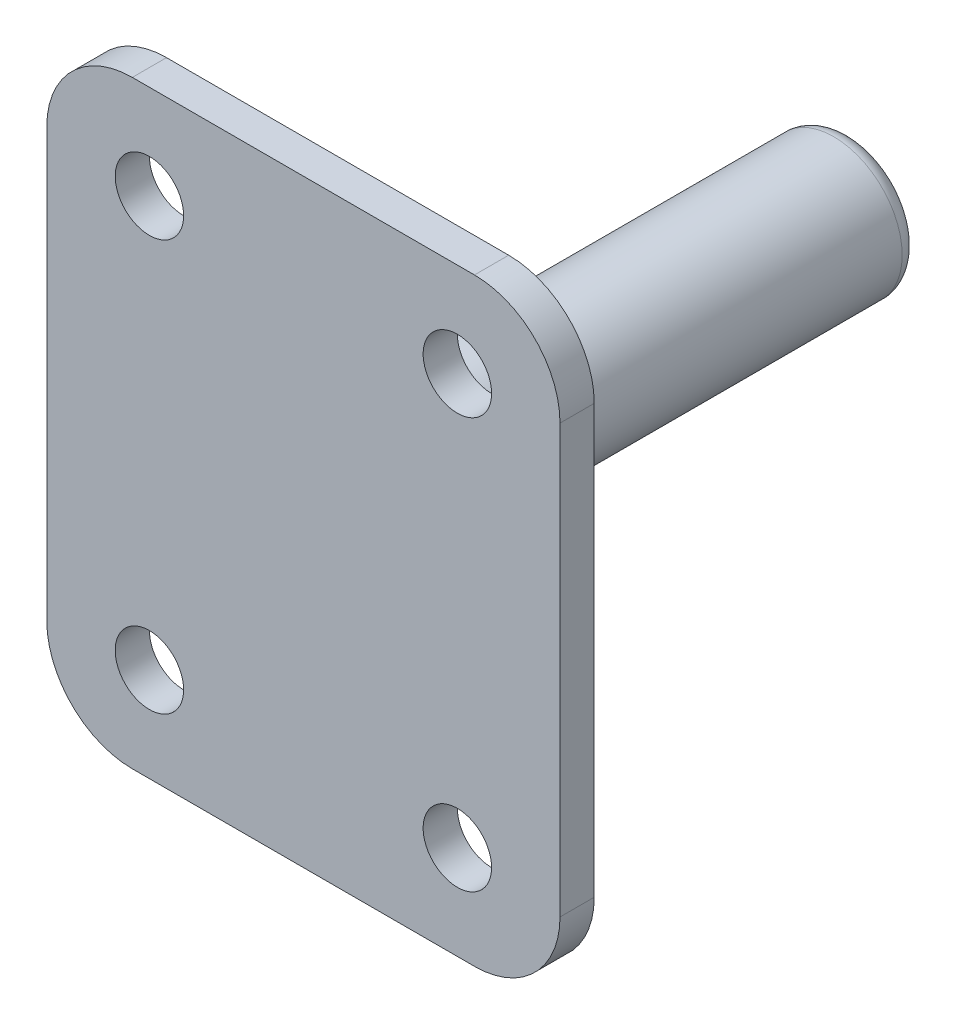
ISO-10303-21;
HEADER;
FILE_DESCRIPTION(('STEP AP214'),'2;1');
FILE_NAME('part.step','',(''),(''),'','','');
FILE_SCHEMA(('AUTOMOTIVE_DESIGN { 1 0 10303 214 1 1 1 1 }'));
ENDSEC;
DATA;
#1=APPLICATION_CONTEXT('core data for automotive mechanical design processes');
#2=APPLICATION_PROTOCOL_DEFINITION('international standard','automotive_design',2000,#1);
#3=PRODUCT_CONTEXT('',#1,'mechanical');
#4=PRODUCT('Part','Part','',(#3));
#5=PRODUCT_RELATED_PRODUCT_CATEGORY('part','',(#4));
#6=PRODUCT_DEFINITION_FORMATION('','',#4);
#7=PRODUCT_DEFINITION_CONTEXT('part definition',#1,'design');
#8=PRODUCT_DEFINITION('design','',#6,#7);
#9=PRODUCT_DEFINITION_SHAPE('','',#8);
#10=(LENGTH_UNIT() NAMED_UNIT(*) SI_UNIT(.MILLI.,.METRE.));
#11=(NAMED_UNIT(*) PLANE_ANGLE_UNIT() SI_UNIT($,.RADIAN.));
#12=(NAMED_UNIT(*) SI_UNIT($,.STERADIAN.) SOLID_ANGLE_UNIT());
#13=UNCERTAINTY_MEASURE_WITH_UNIT(LENGTH_MEASURE(1.E-05),#10,'distance_accuracy_value','');
#14=(GEOMETRIC_REPRESENTATION_CONTEXT(3) GLOBAL_UNCERTAINTY_ASSIGNED_CONTEXT((#13)) GLOBAL_UNIT_ASSIGNED_CONTEXT((#10,
#11,#12)) REPRESENTATION_CONTEXT('',''));
#15=CARTESIAN_POINT('',(0.,0.,0.));
#16=DIRECTION('',(0.,0.,1.));
#17=DIRECTION('',(1.,0.,0.));
#18=AXIS2_PLACEMENT_3D('',#15,#16,#17);
#19=CARTESIAN_POINT('',(0.,0.,2.));
#20=DIRECTION('',(1.,0.,0.));
#21=DIRECTION('',(0.,1.,0.));
#22=AXIS2_PLACEMENT_3D('',#19,#20,#21);
#23=PLANE('',#22);
#24=DIRECTION('',(0.,-1.,0.));
#25=VECTOR('',#24,1.);
#26=CARTESIAN_POINT('',(0.,0.,0.));
#27=LINE('',#26,#25);
#28=CARTESIAN_POINT('',(0.,-5.,0.));
#29=VERTEX_POINT('',#28);
#30=CARTESIAN_POINT('',(0.,-30.,0.));
#31=VERTEX_POINT('',#30);
#32=EDGE_CURVE('E127',#29,#31,#27,.T.);
#33=ORIENTED_EDGE('',*,*,#32,.T.);
#34=DIRECTION('',(0.,0.,-1.));
#35=VECTOR('',#34,1.);
#36=CARTESIAN_POINT('',(0.,-30.,2.));
#37=LINE('',#36,#35);
#38=CARTESIAN_POINT('',(0.,-30.,2.));
#39=VERTEX_POINT('',#38);
#40=EDGE_CURVE('E105',#31,#39,#37,.F.);
#41=ORIENTED_EDGE('',*,*,#40,.T.);
#42=DIRECTION('',(0.,-1.,0.));
#43=VECTOR('',#42,1.);
#44=CARTESIAN_POINT('',(0.,0.,2.));
#45=LINE('',#44,#43);
#46=CARTESIAN_POINT('',(0.,-5.,2.));
#47=VERTEX_POINT('',#46);
#48=EDGE_CURVE('E137',#47,#39,#45,.T.);
#49=ORIENTED_EDGE('',*,*,#48,.F.);
#50=DIRECTION('',(0.,0.,-1.));
#51=VECTOR('',#50,1.);
#52=CARTESIAN_POINT('',(0.,-5.,2.));
#53=LINE('',#52,#51);
#54=EDGE_CURVE('E110',#47,#29,#53,.T.);
#55=ORIENTED_EDGE('',*,*,#54,.T.);
#56=EDGE_LOOP('',(#33,#41,#49,#55));
#57=FACE_BOUND('',#56,.T.);
#58=ADVANCED_FACE('F33',(#57),#23,.F.);
#59=CARTESIAN_POINT('',(0.,-35.,2.));
#60=DIRECTION('',(0.,1.,0.));
#61=DIRECTION('',(0.,0.,1.));
#62=AXIS2_PLACEMENT_3D('',#59,#60,#61);
#63=PLANE('',#62);
#64=DIRECTION('',(1.,0.,0.));
#65=VECTOR('',#64,1.);
#66=CARTESIAN_POINT('',(0.,-35.,2.));
#67=LINE('',#66,#65);
#68=CARTESIAN_POINT('',(5.,-35.,2.));
#69=VERTEX_POINT('',#68);
#70=CARTESIAN_POINT('',(25.,-35.,2.));
#71=VERTEX_POINT('',#70);
#72=EDGE_CURVE('E120',#69,#71,#67,.T.);
#73=ORIENTED_EDGE('',*,*,#72,.F.);
#74=DIRECTION('',(0.,0.,-1.));
#75=VECTOR('',#74,1.);
#76=CARTESIAN_POINT('',(5.,-35.,2.));
#77=LINE('',#76,#75);
#78=CARTESIAN_POINT('',(5.,-35.,0.));
#79=VERTEX_POINT('',#78);
#80=EDGE_CURVE('E104',#69,#79,#77,.T.);
#81=ORIENTED_EDGE('',*,*,#80,.T.);
#82=DIRECTION('',(1.,0.,0.));
#83=VECTOR('',#82,1.);
#84=CARTESIAN_POINT('',(0.,-35.,0.));
#85=LINE('',#84,#83);
#86=CARTESIAN_POINT('',(25.,-35.,0.));
#87=VERTEX_POINT('',#86);
#88=EDGE_CURVE('E117',#79,#87,#85,.T.);
#89=ORIENTED_EDGE('',*,*,#88,.T.);
#90=DIRECTION('',(0.,0.,-1.));
#91=VECTOR('',#90,1.);
#92=CARTESIAN_POINT('',(25.,-35.,2.));
#93=LINE('',#92,#91);
#94=EDGE_CURVE('E122',#87,#71,#93,.F.);
#95=ORIENTED_EDGE('',*,*,#94,.T.);
#96=EDGE_LOOP('',(#73,#81,#89,#95));
#97=FACE_BOUND('',#96,.T.);
#98=ADVANCED_FACE('F116',(#97),#63,.F.);
#99=CARTESIAN_POINT('',(30.,0.,2.));
#100=DIRECTION('',(-1.,0.,0.));
#101=DIRECTION('',(0.,0.,1.));
#102=AXIS2_PLACEMENT_3D('',#99,#100,#101);
#103=PLANE('',#102);
#104=DIRECTION('',(0.,1.,0.));
#105=VECTOR('',#104,1.);
#106=CARTESIAN_POINT('',(30.,0.,2.));
#107=LINE('',#106,#105);
#108=CARTESIAN_POINT('',(30.,-30.,2.));
#109=VERTEX_POINT('',#108);
#110=CARTESIAN_POINT('',(30.,-5.00000000000001,2.));
#111=VERTEX_POINT('',#110);
#112=EDGE_CURVE('E225',#109,#111,#107,.T.);
#113=ORIENTED_EDGE('',*,*,#112,.F.);
#114=DIRECTION('',(0.,0.,-1.));
#115=VECTOR('',#114,1.);
#116=CARTESIAN_POINT('',(30.,-30.,2.));
#117=LINE('',#116,#115);
#118=CARTESIAN_POINT('',(30.,-30.,0.));
#119=VERTEX_POINT('',#118);
#120=EDGE_CURVE('E156',#109,#119,#117,.T.);
#121=ORIENTED_EDGE('',*,*,#120,.T.);
#122=DIRECTION('',(0.,1.,0.));
#123=VECTOR('',#122,1.);
#124=CARTESIAN_POINT('',(30.,0.,0.));
#125=LINE('',#124,#123);
#126=CARTESIAN_POINT('',(30.,-5.00000000000001,0.));
#127=VERTEX_POINT('',#126);
#128=EDGE_CURVE('E126',#119,#127,#125,.T.);
#129=ORIENTED_EDGE('',*,*,#128,.T.);
#130=DIRECTION('',(0.,0.,-1.));
#131=VECTOR('',#130,1.);
#132=CARTESIAN_POINT('',(30.,-5.00000000000001,2.));
#133=LINE('',#132,#131);
#134=EDGE_CURVE('E154',#127,#111,#133,.F.);
#135=ORIENTED_EDGE('',*,*,#134,.T.);
#136=EDGE_LOOP('',(#113,#121,#129,#135));
#137=FACE_BOUND('',#136,.T.);
#138=ADVANCED_FACE('F196',(#137),#103,.F.);
#139=CARTESIAN_POINT('',(0.,0.,2.));
#140=DIRECTION('',(0.,-1.,0.));
#141=DIRECTION('',(1.,0.,0.));
#142=AXIS2_PLACEMENT_3D('',#139,#140,#141);
#143=PLANE('',#142);
#144=DIRECTION('',(-1.,0.,0.));
#145=VECTOR('',#144,1.);
#146=CARTESIAN_POINT('',(0.,0.,2.));
#147=LINE('',#146,#145);
#148=CARTESIAN_POINT('',(25.,0.,2.));
#149=VERTEX_POINT('',#148);
#150=CARTESIAN_POINT('',(5.,0.,2.));
#151=VERTEX_POINT('',#150);
#152=EDGE_CURVE('E138',#149,#151,#147,.T.);
#153=ORIENTED_EDGE('',*,*,#152,.F.);
#154=DIRECTION('',(0.,0.,-1.));
#155=VECTOR('',#154,1.);
#156=CARTESIAN_POINT('',(25.,0.,2.));
#157=LINE('',#156,#155);
#158=CARTESIAN_POINT('',(25.,0.,0.));
#159=VERTEX_POINT('',#158);
#160=EDGE_CURVE('E160',#149,#159,#157,.T.);
#161=ORIENTED_EDGE('',*,*,#160,.T.);
#162=DIRECTION('',(-1.,0.,0.));
#163=VECTOR('',#162,1.);
#164=CARTESIAN_POINT('',(0.,0.,0.));
#165=LINE('',#164,#163);
#166=CARTESIAN_POINT('',(5.,0.,0.));
#167=VERTEX_POINT('',#166);
#168=EDGE_CURVE('E130',#159,#167,#165,.T.);
#169=ORIENTED_EDGE('',*,*,#168,.T.);
#170=DIRECTION('',(0.,0.,-1.));
#171=VECTOR('',#170,1.);
#172=CARTESIAN_POINT('',(5.,0.,2.));
#173=LINE('',#172,#171);
#174=EDGE_CURVE('E48',#167,#151,#173,.F.);
#175=ORIENTED_EDGE('',*,*,#174,.T.);
#176=EDGE_LOOP('',(#153,#161,#169,#175));
#177=FACE_BOUND('',#176,.T.);
#178=ADVANCED_FACE('F237',(#177),#143,.F.);
#179=CARTESIAN_POINT('',(0.,0.,2.));
#180=DIRECTION('',(0.,0.,1.));
#181=DIRECTION('',(1.,0.,0.));
#182=AXIS2_PLACEMENT_3D('',#179,#180,#181);
#183=PLANE('',#182);
#184=CARTESIAN_POINT('',(24.,-5.50000000000001,2.));
#185=DIRECTION('',(0.,0.,1.));
#186=DIRECTION('',(1.,0.,0.));
#187=AXIS2_PLACEMENT_3D('',#184,#185,#186);
#188=CIRCLE('',#187,2.);
#189=CARTESIAN_POINT('',(26.,-5.50000000000001,2.));
#190=VERTEX_POINT('',#189);
#191=EDGE_CURVE('E378',#190,#190,#188,.T.);
#192=ORIENTED_EDGE('',*,*,#191,.F.);
#193=EDGE_LOOP('',(#192));
#194=FACE_BOUND('',#193,.T.);
#195=CARTESIAN_POINT('',(6.,-29.5,2.));
#196=DIRECTION('',(0.,0.,1.));
#197=DIRECTION('',(1.,0.,0.));
#198=AXIS2_PLACEMENT_3D('',#195,#196,#197);
#199=CIRCLE('',#198,2.);
#200=CARTESIAN_POINT('',(8.,-29.5,2.));
#201=VERTEX_POINT('',#200);
#202=EDGE_CURVE('E375',#201,#201,#199,.T.);
#203=ORIENTED_EDGE('',*,*,#202,.F.);
#204=EDGE_LOOP('',(#203));
#205=FACE_BOUND('',#204,.T.);
#206=CARTESIAN_POINT('',(24.,-29.5,2.));
#207=DIRECTION('',(0.,0.,1.));
#208=DIRECTION('',(1.,0.,0.));
#209=AXIS2_PLACEMENT_3D('',#206,#207,#208);
#210=CIRCLE('',#209,2.00000000000001);
#211=CARTESIAN_POINT('',(26.,-29.5,2.));
#212=VERTEX_POINT('',#211);
#213=EDGE_CURVE('E373',#212,#212,#210,.T.);
#214=ORIENTED_EDGE('',*,*,#213,.F.);
#215=EDGE_LOOP('',(#214));
#216=FACE_BOUND('',#215,.T.);
#217=CARTESIAN_POINT('',(6.,-5.50000000000001,2.));
#218=DIRECTION('',(0.,0.,1.));
#219=DIRECTION('',(1.,0.,0.));
#220=AXIS2_PLACEMENT_3D('',#217,#218,#219);
#221=CIRCLE('',#220,2.);
#222=CARTESIAN_POINT('',(8.,-5.50000000000001,2.));
#223=VERTEX_POINT('',#222);
#224=EDGE_CURVE('E168',#223,#223,#221,.T.);
#225=ORIENTED_EDGE('',*,*,#224,.F.);
#226=EDGE_LOOP('',(#225));
#227=FACE_BOUND('',#226,.T.);
#228=ORIENTED_EDGE('',*,*,#48,.T.);
#229=CARTESIAN_POINT('',(5.,-30.,2.));
#230=DIRECTION('',(0.,0.,1.));
#231=DIRECTION('',(1.,0.,0.));
#232=AXIS2_PLACEMENT_3D('',#229,#230,#231);
#233=CIRCLE('',#232,5.);
#234=EDGE_CURVE('E152',#39,#69,#233,.T.);
#235=ORIENTED_EDGE('',*,*,#234,.T.);
#236=ORIENTED_EDGE('',*,*,#72,.T.);
#237=CARTESIAN_POINT('',(25.,-30.,2.));
#238=DIRECTION('',(0.,0.,1.));
#239=DIRECTION('',(1.,0.,0.));
#240=AXIS2_PLACEMENT_3D('',#237,#238,#239);
#241=CIRCLE('',#240,5.);
#242=EDGE_CURVE('E150',#71,#109,#241,.T.);
#243=ORIENTED_EDGE('',*,*,#242,.T.);
#244=ORIENTED_EDGE('',*,*,#112,.T.);
#245=CARTESIAN_POINT('',(25.,-5.00000000000001,2.));
#246=DIRECTION('',(0.,0.,1.));
#247=DIRECTION('',(1.,0.,0.));
#248=AXIS2_PLACEMENT_3D('',#245,#246,#247);
#249=CIRCLE('',#248,5.);
#250=EDGE_CURVE('E55',#111,#149,#249,.T.);
#251=ORIENTED_EDGE('',*,*,#250,.T.);
#252=ORIENTED_EDGE('',*,*,#152,.T.);
#253=CARTESIAN_POINT('',(5.,-5.,2.));
#254=DIRECTION('',(0.,0.,1.));
#255=DIRECTION('',(1.,0.,0.));
#256=AXIS2_PLACEMENT_3D('',#253,#254,#255);
#257=CIRCLE('',#256,5.);
#258=EDGE_CURVE('E147',#151,#47,#257,.T.);
#259=ORIENTED_EDGE('',*,*,#258,.T.);
#260=EDGE_LOOP('',(#228,#235,#236,#243,#244,#251,#252,#259));
#261=FACE_BOUND('',#260,.T.);
#262=ADVANCED_FACE('F223',(#194,#205,#216,#227,#261),#183,.T.);
#263=CARTESIAN_POINT('',(0.,0.,0.));
#264=DIRECTION('',(0.,0.,1.));
#265=DIRECTION('',(1.,0.,0.));
#266=AXIS2_PLACEMENT_3D('',#263,#264,#265);
#267=PLANE('',#266);
#268=CARTESIAN_POINT('',(15.,-17.5,0.));
#269=DIRECTION('',(0.,0.,1.));
#270=DIRECTION('',(1.,0.,0.));
#271=AXIS2_PLACEMENT_3D('',#268,#269,#270);
#272=CIRCLE('',#271,4.);
#273=CARTESIAN_POINT('',(19.,-17.5,0.));
#274=VERTEX_POINT('',#273);
#275=EDGE_CURVE('E163',#274,#274,#272,.F.);
#276=ORIENTED_EDGE('',*,*,#275,.F.);
#277=EDGE_LOOP('',(#276));
#278=FACE_BOUND('',#277,.T.);
#279=CARTESIAN_POINT('',(24.,-5.50000000000001,0.));
#280=DIRECTION('',(0.,0.,1.));
#281=DIRECTION('',(1.,0.,0.));
#282=AXIS2_PLACEMENT_3D('',#279,#280,#281);
#283=CIRCLE('',#282,2.);
#284=CARTESIAN_POINT('',(26.,-5.50000000000001,0.));
#285=VERTEX_POINT('',#284);
#286=EDGE_CURVE('E132',#285,#285,#283,.T.);
#287=ORIENTED_EDGE('',*,*,#286,.T.);
#288=EDGE_LOOP('',(#287));
#289=FACE_BOUND('',#288,.T.);
#290=CARTESIAN_POINT('',(6.,-29.5,0.));
#291=DIRECTION('',(0.,0.,1.));
#292=DIRECTION('',(1.,0.,0.));
#293=AXIS2_PLACEMENT_3D('',#290,#291,#292);
#294=CIRCLE('',#293,2.);
#295=CARTESIAN_POINT('',(8.,-29.5,0.));
#296=VERTEX_POINT('',#295);
#297=EDGE_CURVE('E171',#296,#296,#294,.T.);
#298=ORIENTED_EDGE('',*,*,#297,.T.);
#299=EDGE_LOOP('',(#298));
#300=FACE_BOUND('',#299,.T.);
#301=CARTESIAN_POINT('',(24.,-29.5,0.));
#302=DIRECTION('',(0.,0.,1.));
#303=DIRECTION('',(1.,0.,0.));
#304=AXIS2_PLACEMENT_3D('',#301,#302,#303);
#305=CIRCLE('',#304,2.00000000000001);
#306=CARTESIAN_POINT('',(26.,-29.5,0.));
#307=VERTEX_POINT('',#306);
#308=EDGE_CURVE('E167',#307,#307,#305,.T.);
#309=ORIENTED_EDGE('',*,*,#308,.T.);
#310=EDGE_LOOP('',(#309));
#311=FACE_BOUND('',#310,.T.);
#312=CARTESIAN_POINT('',(6.,-5.50000000000001,0.));
#313=DIRECTION('',(0.,0.,1.));
#314=DIRECTION('',(1.,0.,0.));
#315=AXIS2_PLACEMENT_3D('',#312,#313,#314);
#316=CIRCLE('',#315,2.);
#317=CARTESIAN_POINT('',(8.,-5.50000000000001,0.));
#318=VERTEX_POINT('',#317);
#319=EDGE_CURVE('E164',#318,#318,#316,.T.);
#320=ORIENTED_EDGE('',*,*,#319,.T.);
#321=EDGE_LOOP('',(#320));
#322=FACE_BOUND('',#321,.T.);
#323=ORIENTED_EDGE('',*,*,#88,.F.);
#324=CARTESIAN_POINT('',(5.,-30.,0.));
#325=DIRECTION('',(0.,0.,1.));
#326=DIRECTION('',(1.,0.,0.));
#327=AXIS2_PLACEMENT_3D('',#324,#325,#326);
#328=CIRCLE('',#327,5.);
#329=EDGE_CURVE('E100',#79,#31,#328,.F.);
#330=ORIENTED_EDGE('',*,*,#329,.T.);
#331=ORIENTED_EDGE('',*,*,#32,.F.);
#332=CARTESIAN_POINT('',(5.,-5.,0.));
#333=DIRECTION('',(0.,0.,1.));
#334=DIRECTION('',(1.,0.,0.));
#335=AXIS2_PLACEMENT_3D('',#332,#333,#334);
#336=CIRCLE('',#335,5.);
#337=EDGE_CURVE('E121',#29,#167,#336,.F.);
#338=ORIENTED_EDGE('',*,*,#337,.T.);
#339=ORIENTED_EDGE('',*,*,#168,.F.);
#340=CARTESIAN_POINT('',(25.,-5.00000000000001,0.));
#341=DIRECTION('',(0.,0.,1.));
#342=DIRECTION('',(1.,0.,0.));
#343=AXIS2_PLACEMENT_3D('',#340,#341,#342);
#344=CIRCLE('',#343,5.);
#345=EDGE_CURVE('E141',#159,#127,#344,.F.);
#346=ORIENTED_EDGE('',*,*,#345,.T.);
#347=ORIENTED_EDGE('',*,*,#128,.F.);
#348=CARTESIAN_POINT('',(25.,-30.,0.));
#349=DIRECTION('',(0.,0.,1.));
#350=DIRECTION('',(1.,0.,0.));
#351=AXIS2_PLACEMENT_3D('',#348,#349,#350);
#352=CIRCLE('',#351,5.);
#353=EDGE_CURVE('E111',#119,#87,#352,.F.);
#354=ORIENTED_EDGE('',*,*,#353,.T.);
#355=EDGE_LOOP('',(#323,#330,#331,#338,#339,#346,#347,#354));
#356=FACE_BOUND('',#355,.T.);
#357=ADVANCED_FACE('F124',(#278,#289,#300,#311,#322,#356),#267,.F.);
#358=CARTESIAN_POINT('',(5.,-30.,2.));
#359=DIRECTION('',(0.,0.,-1.));
#360=DIRECTION('',(-1.,0.,0.));
#361=AXIS2_PLACEMENT_3D('',#358,#359,#360);
#362=CYLINDRICAL_SURFACE('',#361,5.);
#363=ORIENTED_EDGE('',*,*,#234,.F.);
#364=ORIENTED_EDGE('',*,*,#40,.F.);
#365=ORIENTED_EDGE('',*,*,#329,.F.);
#366=ORIENTED_EDGE('',*,*,#80,.F.);
#367=EDGE_LOOP('',(#363,#364,#365,#366));
#368=FACE_BOUND('',#367,.T.);
#369=ADVANCED_FACE('F103',(#368),#362,.T.);
#370=CARTESIAN_POINT('',(25.,-30.,2.));
#371=DIRECTION('',(0.,0.,-1.));
#372=DIRECTION('',(-1.,0.,0.));
#373=AXIS2_PLACEMENT_3D('',#370,#371,#372);
#374=CYLINDRICAL_SURFACE('',#373,5.);
#375=ORIENTED_EDGE('',*,*,#242,.F.);
#376=ORIENTED_EDGE('',*,*,#94,.F.);
#377=ORIENTED_EDGE('',*,*,#353,.F.);
#378=ORIENTED_EDGE('',*,*,#120,.F.);
#379=EDGE_LOOP('',(#375,#376,#377,#378));
#380=FACE_BOUND('',#379,.T.);
#381=ADVANCED_FACE('F202',(#380),#374,.T.);
#382=CARTESIAN_POINT('',(25.,-5.00000000000001,2.));
#383=DIRECTION('',(0.,0.,-1.));
#384=DIRECTION('',(-1.,0.,0.));
#385=AXIS2_PLACEMENT_3D('',#382,#383,#384);
#386=CYLINDRICAL_SURFACE('',#385,5.);
#387=ORIENTED_EDGE('',*,*,#250,.F.);
#388=ORIENTED_EDGE('',*,*,#134,.F.);
#389=ORIENTED_EDGE('',*,*,#345,.F.);
#390=ORIENTED_EDGE('',*,*,#160,.F.);
#391=EDGE_LOOP('',(#387,#388,#389,#390));
#392=FACE_BOUND('',#391,.T.);
#393=ADVANCED_FACE('F205',(#392),#386,.T.);
#394=CARTESIAN_POINT('',(5.,-5.,2.));
#395=DIRECTION('',(0.,0.,-1.));
#396=DIRECTION('',(-1.,0.,0.));
#397=AXIS2_PLACEMENT_3D('',#394,#395,#396);
#398=CYLINDRICAL_SURFACE('',#397,5.);
#399=ORIENTED_EDGE('',*,*,#258,.F.);
#400=ORIENTED_EDGE('',*,*,#174,.F.);
#401=ORIENTED_EDGE('',*,*,#337,.F.);
#402=ORIENTED_EDGE('',*,*,#54,.F.);
#403=EDGE_LOOP('',(#399,#400,#401,#402));
#404=FACE_BOUND('',#403,.T.);
#405=ADVANCED_FACE('F208',(#404),#398,.T.);
#406=CARTESIAN_POINT('',(6.,-5.50000000000001,-8.));
#407=DIRECTION('',(0.,0.,1.));
#408=DIRECTION('',(1.,0.,0.));
#409=AXIS2_PLACEMENT_3D('',#406,#407,#408);
#410=CYLINDRICAL_SURFACE('',#409,2.);
#411=ORIENTED_EDGE('',*,*,#224,.T.);
#412=EDGE_LOOP('',(#411));
#413=FACE_BOUND('',#412,.T.);
#414=ORIENTED_EDGE('',*,*,#319,.F.);
#415=EDGE_LOOP('',(#414));
#416=FACE_BOUND('',#415,.T.);
#417=ADVANCED_FACE('F211',(#413,#416),#410,.F.);
#418=CARTESIAN_POINT('',(24.,-29.5,-8.));
#419=DIRECTION('',(0.,0.,1.));
#420=DIRECTION('',(1.,0.,0.));
#421=AXIS2_PLACEMENT_3D('',#418,#419,#420);
#422=CYLINDRICAL_SURFACE('',#421,2.00000000000001);
#423=ORIENTED_EDGE('',*,*,#213,.T.);
#424=EDGE_LOOP('',(#423));
#425=FACE_BOUND('',#424,.T.);
#426=ORIENTED_EDGE('',*,*,#308,.F.);
#427=EDGE_LOOP('',(#426));
#428=FACE_BOUND('',#427,.T.);
#429=ADVANCED_FACE('F216',(#425,#428),#422,.F.);
#430=CARTESIAN_POINT('',(6.,-29.5,-8.));
#431=DIRECTION('',(0.,0.,1.));
#432=DIRECTION('',(1.,0.,0.));
#433=AXIS2_PLACEMENT_3D('',#430,#431,#432);
#434=CYLINDRICAL_SURFACE('',#433,2.);
#435=ORIENTED_EDGE('',*,*,#202,.T.);
#436=EDGE_LOOP('',(#435));
#437=FACE_BOUND('',#436,.T.);
#438=ORIENTED_EDGE('',*,*,#297,.F.);
#439=EDGE_LOOP('',(#438));
#440=FACE_BOUND('',#439,.T.);
#441=ADVANCED_FACE('F250',(#437,#440),#434,.F.);
#442=CARTESIAN_POINT('',(24.,-5.50000000000001,-8.));
#443=DIRECTION('',(0.,0.,1.));
#444=DIRECTION('',(1.,0.,0.));
#445=AXIS2_PLACEMENT_3D('',#442,#443,#444);
#446=CYLINDRICAL_SURFACE('',#445,2.);
#447=ORIENTED_EDGE('',*,*,#191,.T.);
#448=EDGE_LOOP('',(#447));
#449=FACE_BOUND('',#448,.T.);
#450=ORIENTED_EDGE('',*,*,#286,.F.);
#451=EDGE_LOOP('',(#450));
#452=FACE_BOUND('',#451,.T.);
#453=ADVANCED_FACE('F253',(#449,#452),#446,.F.);
#454=CARTESIAN_POINT('',(15.,-17.5,-30.));
#455=DIRECTION('',(0.,0.,1.));
#456=DIRECTION('',(1.,0.,0.));
#457=AXIS2_PLACEMENT_3D('',#454,#455,#456);
#458=CYLINDRICAL_SURFACE('',#457,4.);
#459=CARTESIAN_POINT('',(15.,-17.5,-29.));
#460=DIRECTION('',(0.,0.,-1.));
#461=DIRECTION('',(-1.,0.,0.));
#462=AXIS2_PLACEMENT_3D('',#459,#460,#461);
#463=CIRCLE('',#462,4.);
#464=CARTESIAN_POINT('',(11.,-17.5,-29.));
#465=VERTEX_POINT('',#464);
#466=EDGE_CURVE('E11',#465,#465,#463,.F.);
#467=ORIENTED_EDGE('',*,*,#466,.T.);
#468=EDGE_LOOP('',(#467));
#469=FACE_BOUND('',#468,.T.);
#470=ORIENTED_EDGE('',*,*,#275,.T.);
#471=EDGE_LOOP('',(#470));
#472=FACE_BOUND('',#471,.T.);
#473=ADVANCED_FACE('F187',(#469,#472),#458,.T.);
#474=CARTESIAN_POINT('',(15.,-17.5,-30.));
#475=DIRECTION('',(0.,0.,-1.));
#476=DIRECTION('',(-1.,0.,0.));
#477=AXIS2_PLACEMENT_3D('',#474,#475,#476);
#478=PLANE('',#477);
#479=CARTESIAN_POINT('',(15.,-17.5,-30.));
#480=DIRECTION('',(0.,0.,-1.));
#481=DIRECTION('',(-1.,0.,0.));
#482=AXIS2_PLACEMENT_3D('',#479,#480,#481);
#483=CIRCLE('',#482,3.);
#484=CARTESIAN_POINT('',(12.,-17.5,-30.));
#485=VERTEX_POINT('',#484);
#486=EDGE_CURVE('E41',#485,#485,#483,.T.);
#487=ORIENTED_EDGE('',*,*,#486,.T.);
#488=EDGE_LOOP('',(#487));
#489=FACE_BOUND('',#488,.T.);
#490=ADVANCED_FACE('F180',(#489),#478,.T.);
#491=CARTESIAN_POINT('',(15.,-17.5,-29.));
#492=DIRECTION('',(0.,0.,-1.));
#493=DIRECTION('',(-1.,0.,0.));
#494=AXIS2_PLACEMENT_3D('',#491,#492,#493);
#495=TOROIDAL_SURFACE('',#494,3.,1.);
#496=ORIENTED_EDGE('',*,*,#466,.F.);
#497=EDGE_LOOP('',(#496));
#498=FACE_BOUND('',#497,.T.);
#499=ORIENTED_EDGE('',*,*,#486,.F.);
#500=EDGE_LOOP('',(#499));
#501=FACE_BOUND('',#500,.T.);
#502=ADVANCED_FACE('F35',(#498,#501),#495,.T.);
#503=CLOSED_SHELL('',(#58,#98,#138,#178,#262,#357,#369,#381,#393,#405,#417,#429,#441,#453,#473,
#490,#502));
#504=MANIFOLD_SOLID_BREP('B2',#503);
#505=ADVANCED_BREP_SHAPE_REPRESENTATION('',(#18,#504),#14);
#506=SHAPE_DEFINITION_REPRESENTATION(#9,#505);
ENDSEC;
END-ISO-10303-21;
